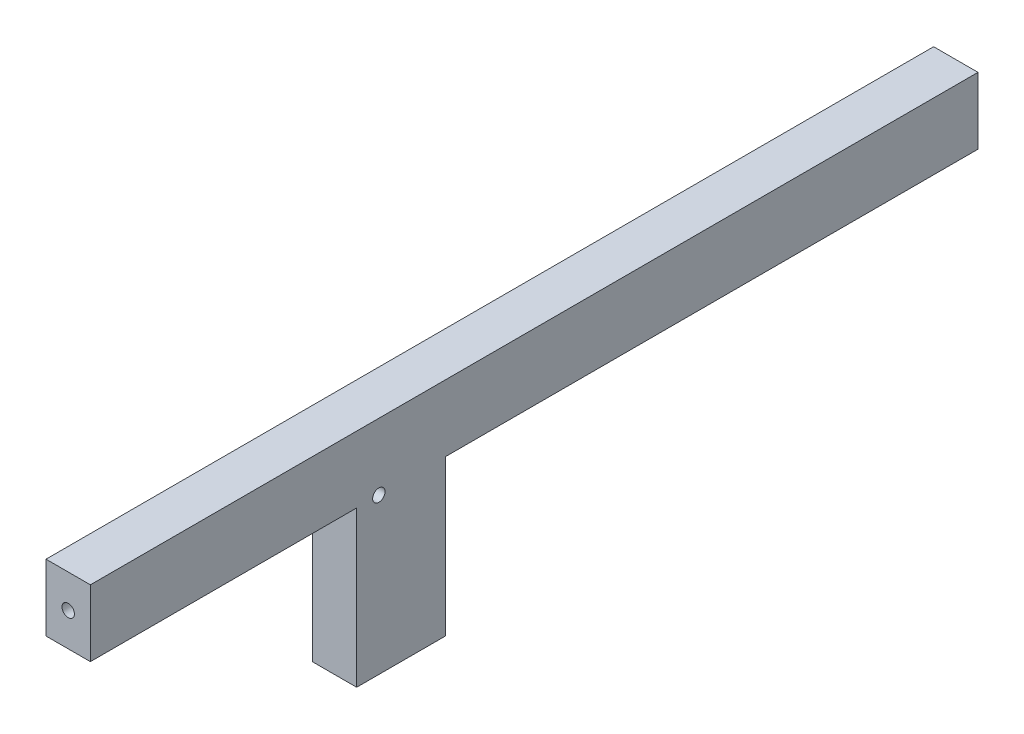
ISO-10303-21;
HEADER;
FILE_DESCRIPTION(('STEP AP214'),'2;1');
FILE_NAME('part.step','',(''),(''),'','','');
FILE_SCHEMA(('AUTOMOTIVE_DESIGN { 1 0 10303 214 1 1 1 1 }'));
ENDSEC;
DATA;
#1=APPLICATION_CONTEXT('core data for automotive mechanical design processes');
#2=APPLICATION_PROTOCOL_DEFINITION('international standard','automotive_design',2000,#1);
#3=PRODUCT_CONTEXT('',#1,'mechanical');
#4=PRODUCT('Part','Part','',(#3));
#5=PRODUCT_RELATED_PRODUCT_CATEGORY('part','',(#4));
#6=PRODUCT_DEFINITION_FORMATION('','',#4);
#7=PRODUCT_DEFINITION_CONTEXT('part definition',#1,'design');
#8=PRODUCT_DEFINITION('design','',#6,#7);
#9=PRODUCT_DEFINITION_SHAPE('','',#8);
#10=(LENGTH_UNIT() NAMED_UNIT(*) SI_UNIT(.MILLI.,.METRE.));
#11=(NAMED_UNIT(*) PLANE_ANGLE_UNIT() SI_UNIT($,.RADIAN.));
#12=(NAMED_UNIT(*) SI_UNIT($,.STERADIAN.) SOLID_ANGLE_UNIT());
#13=UNCERTAINTY_MEASURE_WITH_UNIT(LENGTH_MEASURE(1.E-05),#10,'distance_accuracy_value','');
#14=(GEOMETRIC_REPRESENTATION_CONTEXT(3) GLOBAL_UNCERTAINTY_ASSIGNED_CONTEXT((#13)) GLOBAL_UNIT_ASSIGNED_CONTEXT((#10,
#11,#12)) REPRESENTATION_CONTEXT('',''));
#15=CARTESIAN_POINT('',(0.,0.,0.));
#16=DIRECTION('',(0.,0.,1.));
#17=DIRECTION('',(1.,0.,0.));
#18=AXIS2_PLACEMENT_3D('',#15,#16,#17);
#19=CARTESIAN_POINT('',(3.175,-6.89284911472672,44.45));
#20=DIRECTION('',(0.,0.,-1.));
#21=DIRECTION('',(0.,1.,0.));
#22=AXIS2_PLACEMENT_3D('',#19,#20,#21);
#23=PLANE('',#22);
#24=CARTESIAN_POINT('',(0.,-2.13034911472671,44.45));
#25=DIRECTION('',(0.,0.,1.));
#26=DIRECTION('',(1.,0.,0.));
#27=AXIS2_PLACEMENT_3D('',#24,#25,#26);
#28=CIRCLE('',#27,0.888999999999989);
#29=CARTESIAN_POINT('',(0.889000000000049,-2.13034911472671,44.45));
#30=VERTEX_POINT('',#29);
#31=EDGE_CURVE('E162',#30,#30,#28,.T.);
#32=ORIENTED_EDGE('',*,*,#31,.F.);
#33=EDGE_LOOP('',(#32));
#34=FACE_BOUND('',#33,.T.);
#35=DIRECTION('',(0.,-1.,0.));
#36=VECTOR('',#35,1.);
#37=CARTESIAN_POINT('',(-3.175,-6.89284911472672,44.45));
#38=LINE('',#37,#36);
#39=CARTESIAN_POINT('',(-3.175,2.63215088527328,44.45));
#40=VERTEX_POINT('',#39);
#41=CARTESIAN_POINT('',(-3.175,-6.89284911472672,44.45));
#42=VERTEX_POINT('',#41);
#43=EDGE_CURVE('E234',#40,#42,#38,.T.);
#44=ORIENTED_EDGE('',*,*,#43,.T.);
#45=DIRECTION('',(-1.,0.,0.));
#46=VECTOR('',#45,1.);
#47=CARTESIAN_POINT('',(3.175,-6.89284911472672,44.45));
#48=LINE('',#47,#46);
#49=CARTESIAN_POINT('',(3.175,-6.89284911472672,44.45));
#50=VERTEX_POINT('',#49);
#51=EDGE_CURVE('E11',#50,#42,#48,.T.);
#52=ORIENTED_EDGE('',*,*,#51,.F.);
#53=DIRECTION('',(0.,-1.,0.));
#54=VECTOR('',#53,1.);
#55=CARTESIAN_POINT('',(3.175,-6.89284911472672,44.45));
#56=LINE('',#55,#54);
#57=CARTESIAN_POINT('',(3.175,2.63215088527328,44.45));
#58=VERTEX_POINT('',#57);
#59=EDGE_CURVE('E240',#58,#50,#56,.T.);
#60=ORIENTED_EDGE('',*,*,#59,.F.);
#61=DIRECTION('',(-1.,0.,0.));
#62=VECTOR('',#61,1.);
#63=CARTESIAN_POINT('',(3.175,2.63215088527328,44.45));
#64=LINE('',#63,#62);
#65=EDGE_CURVE('E258',#58,#40,#64,.T.);
#66=ORIENTED_EDGE('',*,*,#65,.T.);
#67=EDGE_LOOP('',(#44,#52,#60,#66));
#68=FACE_BOUND('',#67,.T.);
#69=ADVANCED_FACE('F33',(#34,#68),#23,.F.);
#70=CARTESIAN_POINT('',(3.175,-6.89284911472671,6.35));
#71=DIRECTION('',(0.,1.,0.));
#72=DIRECTION('',(0.,0.,1.));
#73=AXIS2_PLACEMENT_3D('',#70,#71,#72);
#74=PLANE('',#73);
#75=DIRECTION('',(0.,0.,-1.));
#76=VECTOR('',#75,1.);
#77=CARTESIAN_POINT('',(-3.175,-6.89284911472671,6.35));
#78=LINE('',#77,#76);
#79=CARTESIAN_POINT('',(-3.175,-6.89284911472671,6.35));
#80=VERTEX_POINT('',#79);
#81=EDGE_CURVE('E261',#42,#80,#78,.T.);
#82=ORIENTED_EDGE('',*,*,#81,.T.);
#83=DIRECTION('',(-1.,0.,0.));
#84=VECTOR('',#83,1.);
#85=CARTESIAN_POINT('',(3.175,-6.89284911472671,6.35));
#86=LINE('',#85,#84);
#87=CARTESIAN_POINT('',(3.175,-6.89284911472671,6.35));
#88=VERTEX_POINT('',#87);
#89=EDGE_CURVE('E40',#88,#80,#86,.T.);
#90=ORIENTED_EDGE('',*,*,#89,.F.);
#91=DIRECTION('',(0.,0.,-1.));
#92=VECTOR('',#91,1.);
#93=CARTESIAN_POINT('',(3.175,-6.89284911472671,6.35));
#94=LINE('',#93,#92);
#95=EDGE_CURVE('E243',#50,#88,#94,.T.);
#96=ORIENTED_EDGE('',*,*,#95,.F.);
#97=ORIENTED_EDGE('',*,*,#51,.T.);
#98=EDGE_LOOP('',(#82,#90,#96,#97));
#99=FACE_BOUND('',#98,.T.);
#100=ADVANCED_FACE('F318',(#99),#74,.F.);
#101=CARTESIAN_POINT('',(3.175,-29.1178491147267,6.35));
#102=DIRECTION('',(0.,0.,-1.));
#103=DIRECTION('',(-1.,0.,0.));
#104=AXIS2_PLACEMENT_3D('',#101,#102,#103);
#105=PLANE('',#104);
#106=DIRECTION('',(0.,-1.,0.));
#107=VECTOR('',#106,1.);
#108=CARTESIAN_POINT('',(-3.175,-29.1178491147267,6.35));
#109=LINE('',#108,#107);
#110=CARTESIAN_POINT('',(-3.175,-29.1178491147267,6.35));
#111=VERTEX_POINT('',#110);
#112=EDGE_CURVE('E263',#80,#111,#109,.T.);
#113=ORIENTED_EDGE('',*,*,#112,.T.);
#114=DIRECTION('',(-1.,0.,0.));
#115=VECTOR('',#114,1.);
#116=CARTESIAN_POINT('',(3.175,-29.1178491147267,6.35));
#117=LINE('',#116,#115);
#118=CARTESIAN_POINT('',(3.175,-29.1178491147267,6.35));
#119=VERTEX_POINT('',#118);
#120=EDGE_CURVE('E288',#119,#111,#117,.T.);
#121=ORIENTED_EDGE('',*,*,#120,.F.);
#122=DIRECTION('',(0.,-1.,0.));
#123=VECTOR('',#122,1.);
#124=CARTESIAN_POINT('',(3.175,-29.1178491147267,6.35));
#125=LINE('',#124,#123);
#126=EDGE_CURVE('E246',#88,#119,#125,.T.);
#127=ORIENTED_EDGE('',*,*,#126,.F.);
#128=ORIENTED_EDGE('',*,*,#89,.T.);
#129=EDGE_LOOP('',(#113,#121,#127,#128));
#130=FACE_BOUND('',#129,.T.);
#131=ADVANCED_FACE('F295',(#130),#105,.F.);
#132=CARTESIAN_POINT('',(3.175,-29.1178491147267,-6.35));
#133=DIRECTION('',(0.,1.,0.));
#134=DIRECTION('',(0.,0.,1.));
#135=AXIS2_PLACEMENT_3D('',#132,#133,#134);
#136=PLANE('',#135);
#137=DIRECTION('',(0.,0.,-1.));
#138=VECTOR('',#137,1.);
#139=CARTESIAN_POINT('',(-3.175,-29.1178491147267,-6.35));
#140=LINE('',#139,#138);
#141=CARTESIAN_POINT('',(-3.175,-29.1178491147267,-6.35));
#142=VERTEX_POINT('',#141);
#143=EDGE_CURVE('E265',#111,#142,#140,.T.);
#144=ORIENTED_EDGE('',*,*,#143,.T.);
#145=DIRECTION('',(-1.,0.,0.));
#146=VECTOR('',#145,1.);
#147=CARTESIAN_POINT('',(3.175,-29.1178491147267,-6.35));
#148=LINE('',#147,#146);
#149=CARTESIAN_POINT('',(3.175,-29.1178491147267,-6.35));
#150=VERTEX_POINT('',#149);
#151=EDGE_CURVE('E285',#150,#142,#148,.T.);
#152=ORIENTED_EDGE('',*,*,#151,.F.);
#153=DIRECTION('',(0.,0.,-1.));
#154=VECTOR('',#153,1.);
#155=CARTESIAN_POINT('',(3.175,-29.1178491147267,-6.35));
#156=LINE('',#155,#154);
#157=EDGE_CURVE('E248',#119,#150,#156,.T.);
#158=ORIENTED_EDGE('',*,*,#157,.F.);
#159=ORIENTED_EDGE('',*,*,#120,.T.);
#160=EDGE_LOOP('',(#144,#152,#158,#159));
#161=FACE_BOUND('',#160,.T.);
#162=ADVANCED_FACE('F306',(#161),#136,.F.);
#163=CARTESIAN_POINT('',(3.175,-29.1178491147267,-6.35));
#164=DIRECTION('',(0.,0.,1.));
#165=DIRECTION('',(1.,0.,0.));
#166=AXIS2_PLACEMENT_3D('',#163,#164,#165);
#167=PLANE('',#166);
#168=DIRECTION('',(1.,0.,0.));
#169=VECTOR('',#168,1.);
#170=CARTESIAN_POINT('',(1.5875,-22.1852715180442,-6.35));
#171=LINE('',#170,#169);
#172=CARTESIAN_POINT('',(0.,-22.1852715180442,-6.35));
#173=VERTEX_POINT('',#172);
#174=CARTESIAN_POINT('',(1.5875,-22.1852715180442,-6.35));
#175=VERTEX_POINT('',#174);
#176=EDGE_CURVE('E194',#173,#175,#171,.T.);
#177=ORIENTED_EDGE('',*,*,#176,.F.);
#178=DIRECTION('',(0.,1.,0.));
#179=VECTOR('',#178,1.);
#180=CARTESIAN_POINT('',(0.,-22.1852715180442,-6.35));
#181=LINE('',#180,#179);
#182=CARTESIAN_POINT('',(0.,-25.3602715180442,-6.35));
#183=VERTEX_POINT('',#182);
#184=EDGE_CURVE('E47',#183,#173,#181,.T.);
#185=ORIENTED_EDGE('',*,*,#184,.F.);
#186=DIRECTION('',(-1.,0.,0.));
#187=VECTOR('',#186,1.);
#188=CARTESIAN_POINT('',(1.5875,-25.3602715180442,-6.35));
#189=LINE('',#188,#187);
#190=CARTESIAN_POINT('',(1.5875,-25.3602715180442,-6.35));
#191=VERTEX_POINT('',#190);
#192=EDGE_CURVE('E183',#191,#183,#189,.T.);
#193=ORIENTED_EDGE('',*,*,#192,.F.);
#194=DIRECTION('',(0.,-1.,0.));
#195=VECTOR('',#194,1.);
#196=CARTESIAN_POINT('',(1.5875,-22.1852715180442,-6.35));
#197=LINE('',#196,#195);
#198=EDGE_CURVE('E197',#175,#191,#197,.T.);
#199=ORIENTED_EDGE('',*,*,#198,.F.);
#200=EDGE_LOOP('',(#177,#185,#193,#199));
#201=FACE_BOUND('',#200,.T.);
#202=DIRECTION('',(1.,0.,0.));
#203=VECTOR('',#202,1.);
#204=CARTESIAN_POINT('',(1.5875,-9.48527151804418,-6.35));
#205=LINE('',#204,#203);
#206=CARTESIAN_POINT('',(0.,-9.48527151804418,-6.35));
#207=VERTEX_POINT('',#206);
#208=CARTESIAN_POINT('',(1.5875,-9.48527151804418,-6.35));
#209=VERTEX_POINT('',#208);
#210=EDGE_CURVE('E224',#207,#209,#205,.T.);
#211=ORIENTED_EDGE('',*,*,#210,.F.);
#212=DIRECTION('',(0.,1.,0.));
#213=VECTOR('',#212,1.);
#214=CARTESIAN_POINT('',(0.,-9.48527151804418,-6.35));
#215=LINE('',#214,#213);
#216=CARTESIAN_POINT('',(0.,-12.6602715180442,-6.35));
#217=VERTEX_POINT('',#216);
#218=EDGE_CURVE('E55',#217,#207,#215,.T.);
#219=ORIENTED_EDGE('',*,*,#218,.F.);
#220=DIRECTION('',(-1.,0.,0.));
#221=VECTOR('',#220,1.);
#222=CARTESIAN_POINT('',(1.5875,-12.6602715180442,-6.35));
#223=LINE('',#222,#221);
#224=CARTESIAN_POINT('',(1.5875,-12.6602715180442,-6.35));
#225=VERTEX_POINT('',#224);
#226=EDGE_CURVE('E213',#225,#217,#223,.T.);
#227=ORIENTED_EDGE('',*,*,#226,.F.);
#228=DIRECTION('',(0.,-1.,0.));
#229=VECTOR('',#228,1.);
#230=CARTESIAN_POINT('',(1.5875,-9.48527151804418,-6.35));
#231=LINE('',#230,#229);
#232=EDGE_CURVE('E227',#209,#225,#231,.T.);
#233=ORIENTED_EDGE('',*,*,#232,.F.);
#234=EDGE_LOOP('',(#211,#219,#227,#233));
#235=FACE_BOUND('',#234,.T.);
#236=DIRECTION('',(0.,1.,0.));
#237=VECTOR('',#236,1.);
#238=CARTESIAN_POINT('',(-3.175,-29.1178491147267,-6.35));
#239=LINE('',#238,#237);
#240=CARTESIAN_POINT('',(-3.175,-6.89284911472671,-6.35));
#241=VERTEX_POINT('',#240);
#242=EDGE_CURVE('E267',#142,#241,#239,.T.);
#243=ORIENTED_EDGE('',*,*,#242,.T.);
#244=DIRECTION('',(-1.,0.,0.));
#245=VECTOR('',#244,1.);
#246=CARTESIAN_POINT('',(3.175,-6.89284911472671,-6.35));
#247=LINE('',#246,#245);
#248=CARTESIAN_POINT('',(3.175,-6.89284911472671,-6.35));
#249=VERTEX_POINT('',#248);
#250=EDGE_CURVE('E282',#249,#241,#247,.T.);
#251=ORIENTED_EDGE('',*,*,#250,.F.);
#252=DIRECTION('',(0.,1.,0.));
#253=VECTOR('',#252,1.);
#254=CARTESIAN_POINT('',(3.175,-29.1178491147267,-6.35));
#255=LINE('',#254,#253);
#256=EDGE_CURVE('E250',#150,#249,#255,.T.);
#257=ORIENTED_EDGE('',*,*,#256,.F.);
#258=ORIENTED_EDGE('',*,*,#151,.T.);
#259=EDGE_LOOP('',(#243,#251,#257,#258));
#260=FACE_BOUND('',#259,.T.);
#261=ADVANCED_FACE('F310',(#201,#235,#260),#167,.F.);
#262=CARTESIAN_POINT('',(3.175,-6.8928491147267,-82.55));
#263=DIRECTION('',(0.,1.,0.));
#264=DIRECTION('',(0.,0.,1.));
#265=AXIS2_PLACEMENT_3D('',#262,#263,#264);
#266=PLANE('',#265);
#267=DIRECTION('',(0.,0.,-1.));
#268=VECTOR('',#267,1.);
#269=CARTESIAN_POINT('',(-3.175,-6.8928491147267,-82.55));
#270=LINE('',#269,#268);
#271=CARTESIAN_POINT('',(-3.175,-6.8928491147267,-82.55));
#272=VERTEX_POINT('',#271);
#273=EDGE_CURVE('E269',#241,#272,#270,.T.);
#274=ORIENTED_EDGE('',*,*,#273,.T.);
#275=DIRECTION('',(-1.,0.,0.));
#276=VECTOR('',#275,1.);
#277=CARTESIAN_POINT('',(3.175,-6.8928491147267,-82.55));
#278=LINE('',#277,#276);
#279=CARTESIAN_POINT('',(3.175,-6.8928491147267,-82.55));
#280=VERTEX_POINT('',#279);
#281=EDGE_CURVE('E279',#280,#272,#278,.T.);
#282=ORIENTED_EDGE('',*,*,#281,.F.);
#283=DIRECTION('',(0.,0.,-1.));
#284=VECTOR('',#283,1.);
#285=CARTESIAN_POINT('',(3.175,-6.8928491147267,-82.55));
#286=LINE('',#285,#284);
#287=EDGE_CURVE('E252',#249,#280,#286,.T.);
#288=ORIENTED_EDGE('',*,*,#287,.F.);
#289=ORIENTED_EDGE('',*,*,#250,.T.);
#290=EDGE_LOOP('',(#274,#282,#288,#289));
#291=FACE_BOUND('',#290,.T.);
#292=ADVANCED_FACE('F331',(#291),#266,.F.);
#293=CARTESIAN_POINT('',(3.175,-6.8928491147267,-82.55));
#294=DIRECTION('',(0.,0.,1.));
#295=DIRECTION('',(1.,0.,0.));
#296=AXIS2_PLACEMENT_3D('',#293,#294,#295);
#297=PLANE('',#296);
#298=CARTESIAN_POINT('',(1.22298005056365E-13,-2.13034911472666,-82.55));
#299=DIRECTION('',(0.,0.,-1.));
#300=DIRECTION('',(-1.,0.,0.));
#301=AXIS2_PLACEMENT_3D('',#298,#299,#300);
#302=CIRCLE('',#301,0.888999999999989);
#303=CARTESIAN_POINT('',(-0.888999999999866,-2.13034911472666,-82.55));
#304=VERTEX_POINT('',#303);
#305=EDGE_CURVE('E163',#304,#304,#302,.T.);
#306=ORIENTED_EDGE('',*,*,#305,.F.);
#307=EDGE_LOOP('',(#306));
#308=FACE_BOUND('',#307,.T.);
#309=DIRECTION('',(0.,1.,0.));
#310=VECTOR('',#309,1.);
#311=CARTESIAN_POINT('',(-3.175,-6.8928491147267,-82.55));
#312=LINE('',#311,#310);
#313=CARTESIAN_POINT('',(-3.175,2.6321508852733,-82.55));
#314=VERTEX_POINT('',#313);
#315=EDGE_CURVE('E271',#272,#314,#312,.T.);
#316=ORIENTED_EDGE('',*,*,#315,.T.);
#317=DIRECTION('',(-1.,0.,0.));
#318=VECTOR('',#317,1.);
#319=CARTESIAN_POINT('',(3.175,2.6321508852733,-82.55));
#320=LINE('',#319,#318);
#321=CARTESIAN_POINT('',(3.175,2.6321508852733,-82.55));
#322=VERTEX_POINT('',#321);
#323=EDGE_CURVE('E276',#322,#314,#320,.T.);
#324=ORIENTED_EDGE('',*,*,#323,.F.);
#325=DIRECTION('',(0.,1.,0.));
#326=VECTOR('',#325,1.);
#327=CARTESIAN_POINT('',(3.175,-6.8928491147267,-82.55));
#328=LINE('',#327,#326);
#329=EDGE_CURVE('E254',#280,#322,#328,.T.);
#330=ORIENTED_EDGE('',*,*,#329,.F.);
#331=ORIENTED_EDGE('',*,*,#281,.T.);
#332=EDGE_LOOP('',(#316,#324,#330,#331));
#333=FACE_BOUND('',#332,.T.);
#334=ADVANCED_FACE('F329',(#308,#333),#297,.F.);
#335=CARTESIAN_POINT('',(3.175,2.6321508852733,-82.55));
#336=DIRECTION('',(0.,-1.,0.));
#337=DIRECTION('',(0.,0.,-1.));
#338=AXIS2_PLACEMENT_3D('',#335,#336,#337);
#339=PLANE('',#338);
#340=DIRECTION('',(0.,0.,1.));
#341=VECTOR('',#340,1.);
#342=CARTESIAN_POINT('',(-3.175,2.6321508852733,-82.55));
#343=LINE('',#342,#341);
#344=EDGE_CURVE('E244',#314,#40,#343,.T.);
#345=ORIENTED_EDGE('',*,*,#344,.T.);
#346=ORIENTED_EDGE('',*,*,#65,.F.);
#347=DIRECTION('',(0.,0.,1.));
#348=VECTOR('',#347,1.);
#349=CARTESIAN_POINT('',(3.175,2.6321508852733,-82.55));
#350=LINE('',#349,#348);
#351=EDGE_CURVE('E256',#322,#58,#350,.T.);
#352=ORIENTED_EDGE('',*,*,#351,.F.);
#353=ORIENTED_EDGE('',*,*,#323,.T.);
#354=EDGE_LOOP('',(#345,#346,#352,#353));
#355=FACE_BOUND('',#354,.T.);
#356=ADVANCED_FACE('F324',(#355),#339,.F.);
#357=CARTESIAN_POINT('',(3.175,2.63215088527328,44.45));
#358=DIRECTION('',(1.,0.,0.));
#359=DIRECTION('',(0.,0.,-1.));
#360=AXIS2_PLACEMENT_3D('',#357,#358,#359);
#361=PLANE('',#360);
#362=CARTESIAN_POINT('',(3.175,-6.89284911472671,3.17499999999963));
#363=DIRECTION('',(1.,0.,0.));
#364=DIRECTION('',(0.,0.,-1.));
#365=AXIS2_PLACEMENT_3D('',#362,#363,#364);
#366=CIRCLE('',#365,0.888999999999989);
#367=CARTESIAN_POINT('',(3.175,-6.89284911472671,2.28599999999964));
#368=VERTEX_POINT('',#367);
#369=EDGE_CURVE('E173',#368,#368,#366,.T.);
#370=ORIENTED_EDGE('',*,*,#369,.F.);
#371=EDGE_LOOP('',(#370));
#372=FACE_BOUND('',#371,.T.);
#373=ORIENTED_EDGE('',*,*,#59,.T.);
#374=ORIENTED_EDGE('',*,*,#95,.T.);
#375=ORIENTED_EDGE('',*,*,#126,.T.);
#376=ORIENTED_EDGE('',*,*,#157,.T.);
#377=ORIENTED_EDGE('',*,*,#256,.T.);
#378=ORIENTED_EDGE('',*,*,#287,.T.);
#379=ORIENTED_EDGE('',*,*,#329,.T.);
#380=ORIENTED_EDGE('',*,*,#351,.T.);
#381=EDGE_LOOP('',(#373,#374,#375,#376,#377,#378,#379,#380));
#382=FACE_BOUND('',#381,.T.);
#383=ADVANCED_FACE('F314',(#372,#382),#361,.T.);
#384=CARTESIAN_POINT('',(-3.175,2.63215088527328,44.45));
#385=DIRECTION('',(1.,0.,0.));
#386=DIRECTION('',(0.,0.,-1.));
#387=AXIS2_PLACEMENT_3D('',#384,#385,#386);
#388=PLANE('',#387);
#389=ORIENTED_EDGE('',*,*,#43,.F.);
#390=ORIENTED_EDGE('',*,*,#344,.F.);
#391=ORIENTED_EDGE('',*,*,#315,.F.);
#392=ORIENTED_EDGE('',*,*,#273,.F.);
#393=ORIENTED_EDGE('',*,*,#242,.F.);
#394=ORIENTED_EDGE('',*,*,#143,.F.);
#395=ORIENTED_EDGE('',*,*,#112,.F.);
#396=ORIENTED_EDGE('',*,*,#81,.F.);
#397=EDGE_LOOP('',(#389,#390,#391,#392,#393,#394,#395,#396));
#398=FACE_BOUND('',#397,.T.);
#399=ADVANCED_FACE('F301',(#398),#388,.F.);
#400=CARTESIAN_POINT('',(0.,-9.48527151804418,-3.175));
#401=DIRECTION('',(-1.,0.,0.));
#402=DIRECTION('',(0.,0.,1.));
#403=AXIS2_PLACEMENT_3D('',#400,#401,#402);
#404=PLANE('',#403);
#405=ORIENTED_EDGE('',*,*,#218,.T.);
#406=DIRECTION('',(0.,0.,-1.));
#407=VECTOR('',#406,1.);
#408=CARTESIAN_POINT('',(0.,-9.48527151804418,-3.175));
#409=LINE('',#408,#407);
#410=CARTESIAN_POINT('',(0.,-9.48527151804418,-3.175));
#411=VERTEX_POINT('',#410);
#412=EDGE_CURVE('E222',#411,#207,#409,.T.);
#413=ORIENTED_EDGE('',*,*,#412,.F.);
#414=DIRECTION('',(0.,1.,0.));
#415=VECTOR('',#414,1.);
#416=CARTESIAN_POINT('',(0.,-9.48527151804418,-3.175));
#417=LINE('',#416,#415);
#418=CARTESIAN_POINT('',(0.,-12.6602715180442,-3.175));
#419=VERTEX_POINT('',#418);
#420=EDGE_CURVE('E209',#419,#411,#417,.T.);
#421=ORIENTED_EDGE('',*,*,#420,.F.);
#422=DIRECTION('',(0.,0.,-1.));
#423=VECTOR('',#422,1.);
#424=CARTESIAN_POINT('',(0.,-12.6602715180442,-3.175));
#425=LINE('',#424,#423);
#426=EDGE_CURVE('E232',#419,#217,#425,.T.);
#427=ORIENTED_EDGE('',*,*,#426,.T.);
#428=EDGE_LOOP('',(#405,#413,#421,#427));
#429=FACE_BOUND('',#428,.T.);
#430=ADVANCED_FACE('F401',(#429),#404,.F.);
#431=CARTESIAN_POINT('',(1.5875,-12.6602715180442,-3.175));
#432=DIRECTION('',(0.,-1.,0.));
#433=DIRECTION('',(0.,0.,-1.));
#434=AXIS2_PLACEMENT_3D('',#431,#432,#433);
#435=PLANE('',#434);
#436=ORIENTED_EDGE('',*,*,#226,.T.);
#437=ORIENTED_EDGE('',*,*,#426,.F.);
#438=DIRECTION('',(-1.,0.,0.));
#439=VECTOR('',#438,1.);
#440=CARTESIAN_POINT('',(1.5875,-12.6602715180442,-3.175));
#441=LINE('',#440,#439);
#442=CARTESIAN_POINT('',(1.5875,-12.6602715180442,-3.175));
#443=VERTEX_POINT('',#442);
#444=EDGE_CURVE('E219',#443,#419,#441,.T.);
#445=ORIENTED_EDGE('',*,*,#444,.F.);
#446=DIRECTION('',(0.,0.,-1.));
#447=VECTOR('',#446,1.);
#448=CARTESIAN_POINT('',(1.5875,-12.6602715180442,-3.175));
#449=LINE('',#448,#447);
#450=EDGE_CURVE('E235',#443,#225,#449,.T.);
#451=ORIENTED_EDGE('',*,*,#450,.T.);
#452=EDGE_LOOP('',(#436,#437,#445,#451));
#453=FACE_BOUND('',#452,.T.);
#454=ADVANCED_FACE('F397',(#453),#435,.F.);
#455=CARTESIAN_POINT('',(1.5875,-9.48527151804418,-3.175));
#456=DIRECTION('',(1.,0.,0.));
#457=DIRECTION('',(0.,0.,-1.));
#458=AXIS2_PLACEMENT_3D('',#455,#456,#457);
#459=PLANE('',#458);
#460=ORIENTED_EDGE('',*,*,#232,.T.);
#461=ORIENTED_EDGE('',*,*,#450,.F.);
#462=DIRECTION('',(0.,-1.,0.));
#463=VECTOR('',#462,1.);
#464=CARTESIAN_POINT('',(1.5875,-9.48527151804418,-3.175));
#465=LINE('',#464,#463);
#466=CARTESIAN_POINT('',(1.5875,-9.48527151804418,-3.175));
#467=VERTEX_POINT('',#466);
#468=EDGE_CURVE('E216',#467,#443,#465,.T.);
#469=ORIENTED_EDGE('',*,*,#468,.F.);
#470=DIRECTION('',(0.,0.,-1.));
#471=VECTOR('',#470,1.);
#472=CARTESIAN_POINT('',(1.5875,-9.48527151804418,-3.175));
#473=LINE('',#472,#471);
#474=EDGE_CURVE('E237',#467,#209,#473,.T.);
#475=ORIENTED_EDGE('',*,*,#474,.T.);
#476=EDGE_LOOP('',(#460,#461,#469,#475));
#477=FACE_BOUND('',#476,.T.);
#478=ADVANCED_FACE('F400',(#477),#459,.F.);
#479=CARTESIAN_POINT('',(1.5875,-9.48527151804418,-3.175));
#480=DIRECTION('',(0.,1.,0.));
#481=DIRECTION('',(0.,0.,1.));
#482=AXIS2_PLACEMENT_3D('',#479,#480,#481);
#483=PLANE('',#482);
#484=ORIENTED_EDGE('',*,*,#210,.T.);
#485=ORIENTED_EDGE('',*,*,#474,.F.);
#486=DIRECTION('',(1.,0.,0.));
#487=VECTOR('',#486,1.);
#488=CARTESIAN_POINT('',(1.5875,-9.48527151804418,-3.175));
#489=LINE('',#488,#487);
#490=EDGE_CURVE('E212',#411,#467,#489,.T.);
#491=ORIENTED_EDGE('',*,*,#490,.F.);
#492=ORIENTED_EDGE('',*,*,#412,.T.);
#493=EDGE_LOOP('',(#484,#485,#491,#492));
#494=FACE_BOUND('',#493,.T.);
#495=ADVANCED_FACE('F395',(#494),#483,.F.);
#496=CARTESIAN_POINT('',(0.,-12.6602715180442,-3.175));
#497=DIRECTION('',(0.,0.,-1.));
#498=DIRECTION('',(-1.,0.,0.));
#499=AXIS2_PLACEMENT_3D('',#496,#497,#498);
#500=PLANE('',#499);
#501=ORIENTED_EDGE('',*,*,#420,.T.);
#502=ORIENTED_EDGE('',*,*,#490,.T.);
#503=ORIENTED_EDGE('',*,*,#468,.T.);
#504=ORIENTED_EDGE('',*,*,#444,.T.);
#505=EDGE_LOOP('',(#501,#502,#503,#504));
#506=FACE_BOUND('',#505,.T.);
#507=ADVANCED_FACE('F392',(#506),#500,.T.);
#508=CARTESIAN_POINT('',(0.,-22.1852715180442,-3.175));
#509=DIRECTION('',(-1.,0.,0.));
#510=DIRECTION('',(0.,-1.,0.));
#511=AXIS2_PLACEMENT_3D('',#508,#509,#510);
#512=PLANE('',#511);
#513=ORIENTED_EDGE('',*,*,#184,.T.);
#514=DIRECTION('',(0.,0.,-1.));
#515=VECTOR('',#514,1.);
#516=CARTESIAN_POINT('',(0.,-22.1852715180442,-3.175));
#517=LINE('',#516,#515);
#518=CARTESIAN_POINT('',(0.,-22.1852715180442,-3.175));
#519=VERTEX_POINT('',#518);
#520=EDGE_CURVE('E192',#519,#173,#517,.T.);
#521=ORIENTED_EDGE('',*,*,#520,.F.);
#522=DIRECTION('',(0.,1.,0.));
#523=VECTOR('',#522,1.);
#524=CARTESIAN_POINT('',(0.,-22.1852715180442,-3.175));
#525=LINE('',#524,#523);
#526=CARTESIAN_POINT('',(0.,-25.3602715180442,-3.175));
#527=VERTEX_POINT('',#526);
#528=EDGE_CURVE('E179',#527,#519,#525,.T.);
#529=ORIENTED_EDGE('',*,*,#528,.F.);
#530=DIRECTION('',(0.,0.,-1.));
#531=VECTOR('',#530,1.);
#532=CARTESIAN_POINT('',(0.,-25.3602715180442,-3.175));
#533=LINE('',#532,#531);
#534=EDGE_CURVE('E202',#527,#183,#533,.T.);
#535=ORIENTED_EDGE('',*,*,#534,.T.);
#536=EDGE_LOOP('',(#513,#521,#529,#535));
#537=FACE_BOUND('',#536,.T.);
#538=ADVANCED_FACE('F382',(#537),#512,.F.);
#539=CARTESIAN_POINT('',(1.5875,-25.3602715180442,-3.175));
#540=DIRECTION('',(0.,-1.,0.));
#541=DIRECTION('',(0.,0.,-1.));
#542=AXIS2_PLACEMENT_3D('',#539,#540,#541);
#543=PLANE('',#542);
#544=ORIENTED_EDGE('',*,*,#192,.T.);
#545=ORIENTED_EDGE('',*,*,#534,.F.);
#546=DIRECTION('',(-1.,0.,0.));
#547=VECTOR('',#546,1.);
#548=CARTESIAN_POINT('',(1.5875,-25.3602715180442,-3.175));
#549=LINE('',#548,#547);
#550=CARTESIAN_POINT('',(1.5875,-25.3602715180442,-3.175));
#551=VERTEX_POINT('',#550);
#552=EDGE_CURVE('E189',#551,#527,#549,.T.);
#553=ORIENTED_EDGE('',*,*,#552,.F.);
#554=DIRECTION('',(0.,0.,-1.));
#555=VECTOR('',#554,1.);
#556=CARTESIAN_POINT('',(1.5875,-25.3602715180442,-3.175));
#557=LINE('',#556,#555);
#558=EDGE_CURVE('E204',#551,#191,#557,.T.);
#559=ORIENTED_EDGE('',*,*,#558,.T.);
#560=EDGE_LOOP('',(#544,#545,#553,#559));
#561=FACE_BOUND('',#560,.T.);
#562=ADVANCED_FACE('F378',(#561),#543,.F.);
#563=CARTESIAN_POINT('',(1.5875,-22.1852715180442,-3.175));
#564=DIRECTION('',(1.,0.,0.));
#565=DIRECTION('',(0.,1.,0.));
#566=AXIS2_PLACEMENT_3D('',#563,#564,#565);
#567=PLANE('',#566);
#568=ORIENTED_EDGE('',*,*,#198,.T.);
#569=ORIENTED_EDGE('',*,*,#558,.F.);
#570=DIRECTION('',(0.,-1.,0.));
#571=VECTOR('',#570,1.);
#572=CARTESIAN_POINT('',(1.5875,-22.1852715180442,-3.175));
#573=LINE('',#572,#571);
#574=CARTESIAN_POINT('',(1.5875,-22.1852715180442,-3.175));
#575=VERTEX_POINT('',#574);
#576=EDGE_CURVE('E186',#575,#551,#573,.T.);
#577=ORIENTED_EDGE('',*,*,#576,.F.);
#578=DIRECTION('',(0.,0.,-1.));
#579=VECTOR('',#578,1.);
#580=CARTESIAN_POINT('',(1.5875,-22.1852715180442,-3.175));
#581=LINE('',#580,#579);
#582=EDGE_CURVE('E206',#575,#175,#581,.T.);
#583=ORIENTED_EDGE('',*,*,#582,.T.);
#584=EDGE_LOOP('',(#568,#569,#577,#583));
#585=FACE_BOUND('',#584,.T.);
#586=ADVANCED_FACE('F381',(#585),#567,.F.);
#587=CARTESIAN_POINT('',(1.5875,-22.1852715180442,-3.175));
#588=DIRECTION('',(0.,1.,0.));
#589=DIRECTION('',(0.,0.,1.));
#590=AXIS2_PLACEMENT_3D('',#587,#588,#589);
#591=PLANE('',#590);
#592=ORIENTED_EDGE('',*,*,#176,.T.);
#593=ORIENTED_EDGE('',*,*,#582,.F.);
#594=DIRECTION('',(1.,0.,0.));
#595=VECTOR('',#594,1.);
#596=CARTESIAN_POINT('',(1.5875,-22.1852715180442,-3.175));
#597=LINE('',#596,#595);
#598=EDGE_CURVE('E182',#519,#575,#597,.T.);
#599=ORIENTED_EDGE('',*,*,#598,.F.);
#600=ORIENTED_EDGE('',*,*,#520,.T.);
#601=EDGE_LOOP('',(#592,#593,#599,#600));
#602=FACE_BOUND('',#601,.T.);
#603=ADVANCED_FACE('F376',(#602),#591,.F.);
#604=CARTESIAN_POINT('',(0.,-25.3602715180442,-3.175));
#605=DIRECTION('',(0.,0.,-1.));
#606=DIRECTION('',(-1.,0.,0.));
#607=AXIS2_PLACEMENT_3D('',#604,#605,#606);
#608=PLANE('',#607);
#609=ORIENTED_EDGE('',*,*,#528,.T.);
#610=ORIENTED_EDGE('',*,*,#598,.T.);
#611=ORIENTED_EDGE('',*,*,#576,.T.);
#612=ORIENTED_EDGE('',*,*,#552,.T.);
#613=EDGE_LOOP('',(#609,#610,#611,#612));
#614=FACE_BOUND('',#613,.T.);
#615=ADVANCED_FACE('F372',(#614),#608,.T.);
#616=CARTESIAN_POINT('',(-2.413,-6.89284911472671,3.17499999999963));
#617=DIRECTION('',(1.,0.,0.));
#618=DIRECTION('',(0.,0.,-1.));
#619=AXIS2_PLACEMENT_3D('',#616,#617,#618);
#620=CONICAL_SURFACE('',#619,0.888999999999998,1.02974425867665);
#621=CARTESIAN_POINT('',(-2.9471650903155,-6.89284911472671,3.17499999999963));
#622=VERTEX_POINT('',#621);
#623=VERTEX_LOOP('',#622);
#624=FACE_BOUND('',#623,.T.);
#625=CARTESIAN_POINT('',(-2.413,-6.89284911472671,3.17499999999963));
#626=DIRECTION('',(1.,0.,0.));
#627=DIRECTION('',(0.,0.,-1.));
#628=AXIS2_PLACEMENT_3D('',#625,#626,#627);
#629=CIRCLE('',#628,0.888999999999998);
#630=CARTESIAN_POINT('',(-2.413,-6.89284911472671,2.28599999999963));
#631=VERTEX_POINT('',#630);
#632=EDGE_CURVE('E176',#631,#631,#629,.T.);
#633=ORIENTED_EDGE('',*,*,#632,.T.);
#634=EDGE_LOOP('',(#633));
#635=FACE_BOUND('',#634,.T.);
#636=ADVANCED_FACE('F368',(#624,#635),#620,.F.);
#637=CARTESIAN_POINT('',(3.175,-6.89284911472671,3.17499999999963));
#638=DIRECTION('',(1.,0.,0.));
#639=DIRECTION('',(0.,0.,-1.));
#640=AXIS2_PLACEMENT_3D('',#637,#638,#639);
#641=CYLINDRICAL_SURFACE('',#640,0.888999999999994);
#642=ORIENTED_EDGE('',*,*,#632,.F.);
#643=EDGE_LOOP('',(#642));
#644=FACE_BOUND('',#643,.T.);
#645=ORIENTED_EDGE('',*,*,#369,.T.);
#646=EDGE_LOOP('',(#645));
#647=FACE_BOUND('',#646,.T.);
#648=ADVANCED_FACE('F360',(#644,#647),#641,.F.);
#649=CARTESIAN_POINT('',(0.,-2.13034911472671,33.782));
#650=DIRECTION('',(0.,0.,1.));
#651=DIRECTION('',(1.,0.,0.));
#652=AXIS2_PLACEMENT_3D('',#649,#650,#651);
#653=CONICAL_SURFACE('',#652,0.888999999999987,1.02974425867665);
#654=CARTESIAN_POINT('',(0.,-2.13034911472671,33.2478349096845));
#655=VERTEX_POINT('',#654);
#656=VERTEX_LOOP('',#655);
#657=FACE_BOUND('',#656,.T.);
#658=CARTESIAN_POINT('',(0.,-2.13034911472671,33.782));
#659=DIRECTION('',(0.,0.,1.));
#660=DIRECTION('',(1.,0.,0.));
#661=AXIS2_PLACEMENT_3D('',#658,#659,#660);
#662=CIRCLE('',#661,0.888999999999987);
#663=CARTESIAN_POINT('',(0.889000000000047,-2.13034911472671,33.782));
#664=VERTEX_POINT('',#663);
#665=EDGE_CURVE('E166',#664,#664,#662,.T.);
#666=ORIENTED_EDGE('',*,*,#665,.T.);
#667=EDGE_LOOP('',(#666));
#668=FACE_BOUND('',#667,.T.);
#669=ADVANCED_FACE('F354',(#657,#668),#653,.F.);
#670=CARTESIAN_POINT('',(0.,-2.13034911472671,44.45));
#671=DIRECTION('',(0.,0.,1.));
#672=DIRECTION('',(1.,0.,0.));
#673=AXIS2_PLACEMENT_3D('',#670,#671,#672);
#674=CYLINDRICAL_SURFACE('',#673,0.888999999999988);
#675=ORIENTED_EDGE('',*,*,#665,.F.);
#676=EDGE_LOOP('',(#675));
#677=FACE_BOUND('',#676,.T.);
#678=ORIENTED_EDGE('',*,*,#31,.T.);
#679=EDGE_LOOP('',(#678));
#680=FACE_BOUND('',#679,.T.);
#681=ADVANCED_FACE('F156',(#677,#680),#674,.F.);
#682=CARTESIAN_POINT('',(1.22298005056365E-13,-2.13034911472666,-71.882));
#683=DIRECTION('',(0.,0.,-1.));
#684=DIRECTION('',(-1.,0.,0.));
#685=AXIS2_PLACEMENT_3D('',#682,#683,#684);
#686=CONICAL_SURFACE('',#685,0.888999999999987,1.02974425867665);
#687=CARTESIAN_POINT('',(1.1916814506531E-13,-2.13034911472666,-71.3478349096845));
#688=VERTEX_POINT('',#687);
#689=VERTEX_LOOP('',#688);
#690=FACE_BOUND('',#689,.T.);
#691=CARTESIAN_POINT('',(1.22298005056365E-13,-2.13034911472666,-71.882));
#692=DIRECTION('',(0.,0.,-1.));
#693=DIRECTION('',(-1.,0.,0.));
#694=AXIS2_PLACEMENT_3D('',#691,#692,#693);
#695=CIRCLE('',#694,0.888999999999987);
#696=CARTESIAN_POINT('',(-0.888999999999865,-2.13034911472666,-71.882));
#697=VERTEX_POINT('',#696);
#698=EDGE_CURVE('E160',#697,#697,#695,.T.);
#699=ORIENTED_EDGE('',*,*,#698,.T.);
#700=EDGE_LOOP('',(#699));
#701=FACE_BOUND('',#700,.T.);
#702=ADVANCED_FACE('F152',(#690,#701),#686,.F.);
#703=CARTESIAN_POINT('',(1.22298005056365E-13,-2.13034911472666,-82.55));
#704=DIRECTION('',(0.,0.,-1.));
#705=DIRECTION('',(-1.,0.,0.));
#706=AXIS2_PLACEMENT_3D('',#703,#704,#705);
#707=CYLINDRICAL_SURFACE('',#706,0.888999999999988);
#708=ORIENTED_EDGE('',*,*,#698,.F.);
#709=EDGE_LOOP('',(#708));
#710=FACE_BOUND('',#709,.T.);
#711=ORIENTED_EDGE('',*,*,#305,.T.);
#712=EDGE_LOOP('',(#711));
#713=FACE_BOUND('',#712,.T.);
#714=ADVANCED_FACE('F155',(#710,#713),#707,.F.);
#715=CLOSED_SHELL('',(#69,#100,#131,#162,#261,#292,#334,#356,#383,#399,#430,#454,#478,#495,#507,
#538,#562,#586,#603,#615,#636,#648,#669,#681,#702,#714));
#716=MANIFOLD_SOLID_BREP('B2',#715);
#717=ADVANCED_BREP_SHAPE_REPRESENTATION('',(#18,#716),#14);
#718=SHAPE_DEFINITION_REPRESENTATION(#9,#717);
ENDSEC;
END-ISO-10303-21;
